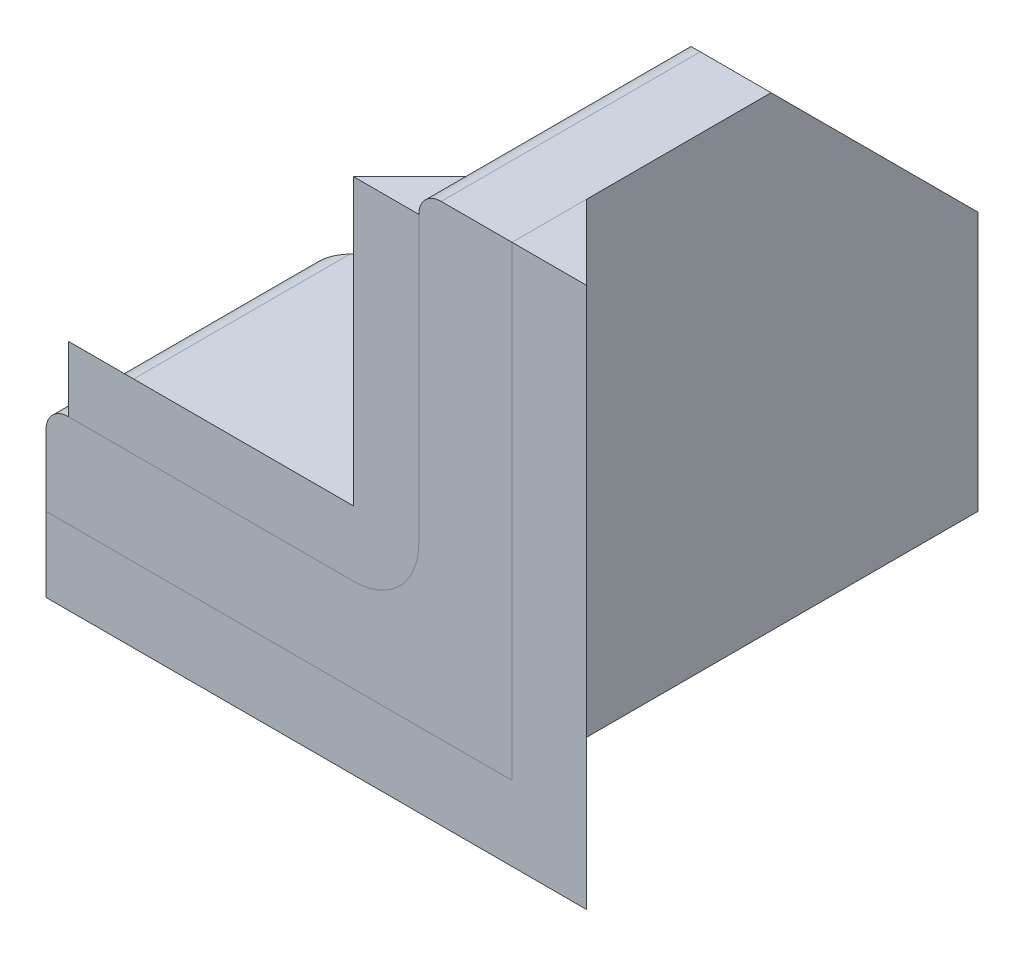
ISO-10303-21;
HEADER;
FILE_DESCRIPTION(('STEP AP214'),'2;1');
FILE_NAME('part.step','',(''),(''),'','','');
FILE_SCHEMA(('AUTOMOTIVE_DESIGN { 1 0 10303 214 1 1 1 1 }'));
ENDSEC;
DATA;
#1=APPLICATION_CONTEXT('core data for automotive mechanical design processes');
#2=APPLICATION_PROTOCOL_DEFINITION('international standard','automotive_design',2000,#1);
#3=PRODUCT_CONTEXT('',#1,'mechanical');
#4=PRODUCT('Part','Part','',(#3));
#5=PRODUCT_RELATED_PRODUCT_CATEGORY('part','',(#4));
#6=PRODUCT_DEFINITION_FORMATION('','',#4);
#7=PRODUCT_DEFINITION_CONTEXT('part definition',#1,'design');
#8=PRODUCT_DEFINITION('design','',#6,#7);
#9=PRODUCT_DEFINITION_SHAPE('','',#8);
#10=(LENGTH_UNIT() NAMED_UNIT(*) SI_UNIT(.MILLI.,.METRE.));
#11=(NAMED_UNIT(*) PLANE_ANGLE_UNIT() SI_UNIT($,.RADIAN.));
#12=(NAMED_UNIT(*) SI_UNIT($,.STERADIAN.) SOLID_ANGLE_UNIT());
#13=UNCERTAINTY_MEASURE_WITH_UNIT(LENGTH_MEASURE(1.E-05),#10,'distance_accuracy_value','');
#14=(GEOMETRIC_REPRESENTATION_CONTEXT(3) GLOBAL_UNCERTAINTY_ASSIGNED_CONTEXT((#13)) GLOBAL_UNIT_ASSIGNED_CONTEXT((#10,
#11,#12)) REPRESENTATION_CONTEXT('',''));
#15=CARTESIAN_POINT('',(0.,0.,0.));
#16=DIRECTION('',(0.,0.,1.));
#17=DIRECTION('',(1.,0.,0.));
#18=AXIS2_PLACEMENT_3D('',#15,#16,#17);
#19=CARTESIAN_POINT('',(0.,0.,-4.));
#20=DIRECTION('',(0.,-1.,0.));
#21=DIRECTION('',(1.,0.,0.));
#22=AXIS2_PLACEMENT_3D('',#19,#20,#21);
#23=PLANE('',#22);
#24=DIRECTION('',(0.,0.,-1.));
#25=VECTOR('',#24,1.);
#26=CARTESIAN_POINT('',(-25.,0.,-4.));
#27=LINE('',#26,#25);
#28=CARTESIAN_POINT('',(-25.,0.,0.));
#29=VERTEX_POINT('',#28);
#30=CARTESIAN_POINT('',(-25.,0.,-4.));
#31=VERTEX_POINT('',#30);
#32=EDGE_CURVE('E63',#29,#31,#27,.T.);
#33=ORIENTED_EDGE('',*,*,#32,.F.);
#34=DIRECTION('',(-1.,0.,0.));
#35=VECTOR('',#34,1.);
#36=CARTESIAN_POINT('',(0.,0.,0.));
#37=LINE('',#36,#35);
#38=CARTESIAN_POINT('',(0.,0.,0.));
#39=VERTEX_POINT('',#38);
#40=EDGE_CURVE('E128',#39,#29,#37,.T.);
#41=ORIENTED_EDGE('',*,*,#40,.F.);
#42=DIRECTION('',(0.,0.,1.));
#43=VECTOR('',#42,1.);
#44=CARTESIAN_POINT('',(0.,0.,-4.));
#45=LINE('',#44,#43);
#46=CARTESIAN_POINT('',(0.,0.,-4.));
#47=VERTEX_POINT('',#46);
#48=EDGE_CURVE('E120',#47,#39,#45,.T.);
#49=ORIENTED_EDGE('',*,*,#48,.F.);
#50=DIRECTION('',(-1.,0.,0.));
#51=VECTOR('',#50,1.);
#52=CARTESIAN_POINT('',(0.,0.,-4.));
#53=LINE('',#52,#51);
#54=EDGE_CURVE('E133',#47,#31,#53,.T.);
#55=ORIENTED_EDGE('',*,*,#54,.T.);
#56=EDGE_LOOP('',(#33,#41,#49,#55));
#57=FACE_BOUND('',#56,.T.);
#58=ADVANCED_FACE('F55',(#57),#23,.F.);
#59=CARTESIAN_POINT('',(5.21895141649746,-5.21895141649746,1.21895141649746));
#60=DIRECTION('',(0.,0.707106781186547,0.707106781186547));
#61=DIRECTION('',(0.,-0.707106781186548,0.707106781186548));
#62=AXIS2_PLACEMENT_3D('',#59,#60,#61);
#63=PLANE('',#62);
#64=DIRECTION('',(0.,-0.707106781186548,0.707106781186548));
#65=VECTOR('',#64,1.);
#66=CARTESIAN_POINT('',(-25.,-5.21895141649746,1.21895141649746));
#67=LINE('',#66,#65);
#68=CARTESIAN_POINT('',(-25.,-4.,0.));
#69=VERTEX_POINT('',#68);
#70=EDGE_CURVE('E13',#31,#69,#67,.T.);
#71=ORIENTED_EDGE('',*,*,#70,.F.);
#72=ORIENTED_EDGE('',*,*,#54,.F.);
#73=DIRECTION('',(-0.577350269189626,0.577350269189626,-0.577350269189626));
#74=VECTOR('',#73,1.);
#75=CARTESIAN_POINT('',(5.21895141649746,-5.21895141649746,1.21895141649746));
#76=LINE('',#75,#74);
#77=CARTESIAN_POINT('',(4.,-4.,0.));
#78=VERTEX_POINT('',#77);
#79=EDGE_CURVE('E104',#78,#47,#76,.T.);
#80=ORIENTED_EDGE('',*,*,#79,.F.);
#81=DIRECTION('',(-1.,0.,0.));
#82=VECTOR('',#81,1.);
#83=CARTESIAN_POINT('',(4.,-4.,0.));
#84=LINE('',#83,#82);
#85=EDGE_CURVE('E131',#78,#69,#84,.T.);
#86=ORIENTED_EDGE('',*,*,#85,.T.);
#87=EDGE_LOOP('',(#71,#72,#80,#86));
#88=FACE_BOUND('',#87,.T.);
#89=ADVANCED_FACE('F57',(#88),#63,.F.);
#90=CARTESIAN_POINT('',(0.,25.,-4.));
#91=DIRECTION('',(0.,1.,0.));
#92=DIRECTION('',(0.,0.,1.));
#93=AXIS2_PLACEMENT_3D('',#90,#91,#92);
#94=PLANE('',#93);
#95=DIRECTION('',(-0.707106781186548,0.,-0.707106781186548));
#96=VECTOR('',#95,1.);
#97=CARTESIAN_POINT('',(4.,25.,0.));
#98=LINE('',#97,#96);
#99=CARTESIAN_POINT('',(4.,25.,0.));
#100=VERTEX_POINT('',#99);
#101=CARTESIAN_POINT('',(0.,25.,-4.));
#102=VERTEX_POINT('',#101);
#103=EDGE_CURVE('E101',#100,#102,#98,.T.);
#104=ORIENTED_EDGE('',*,*,#103,.T.);
#105=DIRECTION('',(0.,0.,1.));
#106=VECTOR('',#105,1.);
#107=CARTESIAN_POINT('',(0.,25.,-4.));
#108=LINE('',#107,#106);
#109=CARTESIAN_POINT('',(0.,25.,0.));
#110=VERTEX_POINT('',#109);
#111=EDGE_CURVE('E111',#102,#110,#108,.T.);
#112=ORIENTED_EDGE('',*,*,#111,.T.);
#113=DIRECTION('',(1.,0.,0.));
#114=VECTOR('',#113,1.);
#115=CARTESIAN_POINT('',(0.,25.,0.));
#116=LINE('',#115,#114);
#117=EDGE_CURVE('E108',#110,#100,#116,.T.);
#118=ORIENTED_EDGE('',*,*,#117,.T.);
#119=EDGE_LOOP('',(#104,#112,#118));
#120=FACE_BOUND('',#119,.T.);
#121=ADVANCED_FACE('F117',(#120),#94,.T.);
#122=CARTESIAN_POINT('',(4.,-7.65685424949238,0.));
#123=DIRECTION('',(0.707106781186547,0.,-0.707106781186547));
#124=DIRECTION('',(-0.707106781186548,0.,-0.707106781186548));
#125=AXIS2_PLACEMENT_3D('',#122,#123,#124);
#126=PLANE('',#125);
#127=DIRECTION('',(0.,1.,0.));
#128=VECTOR('',#127,1.);
#129=CARTESIAN_POINT('',(4.,-7.65685424949238,0.));
#130=LINE('',#129,#128);
#131=EDGE_CURVE('E124',#78,#100,#130,.T.);
#132=ORIENTED_EDGE('',*,*,#131,.F.);
#133=ORIENTED_EDGE('',*,*,#79,.T.);
#134=DIRECTION('',(0.,1.,0.));
#135=VECTOR('',#134,1.);
#136=CARTESIAN_POINT('',(0.,-7.65685424949238,-4.));
#137=LINE('',#136,#135);
#138=EDGE_CURVE('E96',#47,#102,#137,.T.);
#139=ORIENTED_EDGE('',*,*,#138,.T.);
#140=ORIENTED_EDGE('',*,*,#103,.F.);
#141=EDGE_LOOP('',(#132,#133,#139,#140));
#142=FACE_BOUND('',#141,.T.);
#143=ADVANCED_FACE('F99',(#142),#126,.T.);
#144=CARTESIAN_POINT('',(0.,-7.65685424949238,-4.));
#145=DIRECTION('',(-1.,0.,0.));
#146=DIRECTION('',(0.,0.,1.));
#147=AXIS2_PLACEMENT_3D('',#144,#145,#146);
#148=PLANE('',#147);
#149=ORIENTED_EDGE('',*,*,#138,.F.);
#150=ORIENTED_EDGE('',*,*,#48,.T.);
#151=DIRECTION('',(0.,1.,0.));
#152=VECTOR('',#151,1.);
#153=CARTESIAN_POINT('',(0.,-7.65685424949238,0.));
#154=LINE('',#153,#152);
#155=EDGE_CURVE('E107',#39,#110,#154,.T.);
#156=ORIENTED_EDGE('',*,*,#155,.T.);
#157=ORIENTED_EDGE('',*,*,#111,.F.);
#158=EDGE_LOOP('',(#149,#150,#156,#157));
#159=FACE_BOUND('',#158,.T.);
#160=ADVANCED_FACE('F112',(#159),#148,.T.);
#161=CARTESIAN_POINT('',(0.,-7.65685424949238,0.));
#162=DIRECTION('',(0.,0.,1.));
#163=DIRECTION('',(1.,0.,0.));
#164=AXIS2_PLACEMENT_3D('',#161,#162,#163);
#165=PLANE('',#164);
#166=ORIENTED_EDGE('',*,*,#155,.F.);
#167=ORIENTED_EDGE('',*,*,#40,.T.);
#168=DIRECTION('',(0.,1.,0.));
#169=VECTOR('',#168,1.);
#170=CARTESIAN_POINT('',(-25.,-3.82842712474619,0.));
#171=LINE('',#170,#169);
#172=EDGE_CURVE('E71',#69,#29,#171,.T.);
#173=ORIENTED_EDGE('',*,*,#172,.F.);
#174=ORIENTED_EDGE('',*,*,#85,.F.);
#175=ORIENTED_EDGE('',*,*,#131,.T.);
#176=ORIENTED_EDGE('',*,*,#117,.F.);
#177=EDGE_LOOP('',(#166,#167,#173,#174,#175,#176));
#178=FACE_BOUND('',#177,.T.);
#179=ADVANCED_FACE('F140',(#178),#165,.T.);
#180=CARTESIAN_POINT('',(-25.,-2.,-2.));
#181=DIRECTION('',(-1.,0.,0.));
#182=DIRECTION('',(0.,-1.,0.));
#183=AXIS2_PLACEMENT_3D('',#180,#181,#182);
#184=PLANE('',#183);
#185=ORIENTED_EDGE('',*,*,#32,.T.);
#186=ORIENTED_EDGE('',*,*,#70,.T.);
#187=ORIENTED_EDGE('',*,*,#172,.T.);
#188=EDGE_LOOP('',(#185,#186,#187));
#189=FACE_BOUND('',#188,.T.);
#190=ADVANCED_FACE('F138',(#189),#184,.T.);
#191=CLOSED_SHELL('',(#58,#89,#121,#143,#160,#179,#190));
#192=MANIFOLD_SOLID_BREP('B2',#191);
#193=CARTESIAN_POINT('',(-8.5,5.,-3.5));
#194=DIRECTION('',(0.,-0.707106781186548,0.707106781186548));
#195=DIRECTION('',(0.,-0.707106781186548,-0.707106781186548));
#196=AXIS2_PLACEMENT_3D('',#193,#194,#195);
#197=PLANE('',#196);
#198=DIRECTION('',(0.,0.707106781186547,0.707106781186547));
#199=VECTOR('',#198,1.);
#200=CARTESIAN_POINT('',(-8.5,5.,-3.5));
#201=LINE('',#200,#199);
#202=CARTESIAN_POINT('',(-8.5,5.,-3.5));
#203=VERTEX_POINT('',#202);
#204=CARTESIAN_POINT('',(-8.5,8.5,0.));
#205=VERTEX_POINT('',#204);
#206=EDGE_CURVE('E272',#203,#205,#201,.T.);
#207=ORIENTED_EDGE('',*,*,#206,.F.);
#208=DIRECTION('',(-1.,0.,0.));
#209=VECTOR('',#208,1.);
#210=CARTESIAN_POINT('',(-8.5,5.,-3.5));
#211=LINE('',#210,#209);
#212=CARTESIAN_POINT('',(-23.8,5.,-3.5));
#213=VERTEX_POINT('',#212);
#214=EDGE_CURVE('E218',#203,#213,#211,.T.);
#215=ORIENTED_EDGE('',*,*,#214,.T.);
#216=DIRECTION('',(0.,0.707106781186547,0.707106781186547));
#217=VECTOR('',#216,1.);
#218=CARTESIAN_POINT('',(-23.8,5.,-3.5));
#219=LINE('',#218,#217);
#220=CARTESIAN_POINT('',(-23.8,8.5,0.));
#221=VERTEX_POINT('',#220);
#222=EDGE_CURVE('E225',#213,#221,#219,.T.);
#223=ORIENTED_EDGE('',*,*,#222,.T.);
#224=DIRECTION('',(-1.,0.,0.));
#225=VECTOR('',#224,1.);
#226=CARTESIAN_POINT('',(-8.5,8.5,0.));
#227=LINE('',#226,#225);
#228=EDGE_CURVE('E53',#205,#221,#227,.T.);
#229=ORIENTED_EDGE('',*,*,#228,.F.);
#230=EDGE_LOOP('',(#207,#215,#223,#229));
#231=FACE_BOUND('',#230,.T.);
#232=ADVANCED_FACE('F211',(#231),#197,.F.);
#233=CARTESIAN_POINT('',(-8.5,5.,0.));
#234=DIRECTION('',(0.,1.,0.));
#235=DIRECTION('',(-1.,0.,0.));
#236=AXIS2_PLACEMENT_3D('',#233,#234,#235);
#237=PLANE('',#236);
#238=DIRECTION('',(0.,0.,-1.));
#239=VECTOR('',#238,1.);
#240=CARTESIAN_POINT('',(-8.5,5.,0.));
#241=LINE('',#240,#239);
#242=CARTESIAN_POINT('',(-8.5,5.,0.));
#243=VERTEX_POINT('',#242);
#244=EDGE_CURVE('E295',#243,#203,#241,.T.);
#245=ORIENTED_EDGE('',*,*,#244,.F.);
#246=DIRECTION('',(-1.,0.,0.));
#247=VECTOR('',#246,1.);
#248=CARTESIAN_POINT('',(-8.5,5.,0.));
#249=LINE('',#248,#247);
#250=CARTESIAN_POINT('',(-23.8,5.,0.));
#251=VERTEX_POINT('',#250);
#252=EDGE_CURVE('E267',#243,#251,#249,.T.);
#253=ORIENTED_EDGE('',*,*,#252,.T.);
#254=DIRECTION('',(0.,0.,-1.));
#255=VECTOR('',#254,1.);
#256=CARTESIAN_POINT('',(-23.8,5.,0.));
#257=LINE('',#256,#255);
#258=EDGE_CURVE('E233',#251,#213,#257,.T.);
#259=ORIENTED_EDGE('',*,*,#258,.T.);
#260=ORIENTED_EDGE('',*,*,#214,.F.);
#261=EDGE_LOOP('',(#245,#253,#259,#260));
#262=FACE_BOUND('',#261,.T.);
#263=ADVANCED_FACE('F305',(#262),#237,.F.);
#264=CARTESIAN_POINT('',(-8.5,8.5,-3.5));
#265=DIRECTION('',(0.,0.,-1.));
#266=DIRECTION('',(-1.,0.,0.));
#267=AXIS2_PLACEMENT_3D('',#264,#265,#266);
#268=CONICAL_SURFACE('',#267,3.5,0.785398163397448);
#269=DIRECTION('',(-0.707106781186547,0.,0.707106781186547));
#270=VECTOR('',#269,1.);
#271=CARTESIAN_POINT('',(-5.,8.5,-3.5));
#272=LINE('',#271,#270);
#273=CARTESIAN_POINT('',(-5.,8.5,-3.5));
#274=VERTEX_POINT('',#273);
#275=EDGE_CURVE('E280',#274,#205,#272,.T.);
#276=ORIENTED_EDGE('',*,*,#275,.F.);
#277=CARTESIAN_POINT('',(-8.5,8.5,-3.5));
#278=DIRECTION('',(0.,0.,-1.));
#279=DIRECTION('',(-1.,0.,0.));
#280=AXIS2_PLACEMENT_3D('',#277,#278,#279);
#281=CIRCLE('',#280,3.5);
#282=EDGE_CURVE('E271',#274,#203,#281,.T.);
#283=ORIENTED_EDGE('',*,*,#282,.T.);
#284=ORIENTED_EDGE('',*,*,#206,.T.);
#285=EDGE_LOOP('',(#276,#283,#284));
#286=FACE_BOUND('',#285,.T.);
#287=ADVANCED_FACE('F307',(#286),#268,.F.);
#288=CARTESIAN_POINT('',(-8.5,8.5,0.));
#289=DIRECTION('',(0.,0.,-1.));
#290=DIRECTION('',(-1.,0.,0.));
#291=AXIS2_PLACEMENT_3D('',#288,#289,#290);
#292=CYLINDRICAL_SURFACE('',#291,3.5);
#293=DIRECTION('',(0.,0.,-1.));
#294=VECTOR('',#293,1.);
#295=CARTESIAN_POINT('',(-5.,8.5,0.));
#296=LINE('',#295,#294);
#297=CARTESIAN_POINT('',(-5.,8.5,0.));
#298=VERTEX_POINT('',#297);
#299=EDGE_CURVE('E275',#298,#274,#296,.T.);
#300=ORIENTED_EDGE('',*,*,#299,.F.);
#301=CARTESIAN_POINT('',(-8.5,8.5,0.));
#302=DIRECTION('',(0.,0.,-1.));
#303=DIRECTION('',(-1.,0.,0.));
#304=AXIS2_PLACEMENT_3D('',#301,#302,#303);
#305=CIRCLE('',#304,3.5);
#306=EDGE_CURVE('E260',#298,#243,#305,.T.);
#307=ORIENTED_EDGE('',*,*,#306,.T.);
#308=ORIENTED_EDGE('',*,*,#244,.T.);
#309=ORIENTED_EDGE('',*,*,#282,.F.);
#310=EDGE_LOOP('',(#300,#307,#308,#309));
#311=FACE_BOUND('',#310,.T.);
#312=ADVANCED_FACE('F276',(#311),#292,.T.);
#313=CARTESIAN_POINT('',(-8.5,8.5,0.));
#314=DIRECTION('',(0.,0.,1.));
#315=DIRECTION('',(1.,0.,0.));
#316=AXIS2_PLACEMENT_3D('',#313,#314,#315);
#317=PLANE('',#316);
#318=DIRECTION('',(1.,0.,0.));
#319=VECTOR('',#318,1.);
#320=CARTESIAN_POINT('',(-8.5,23.8,0.));
#321=LINE('',#320,#319);
#322=CARTESIAN_POINT('',(-8.5,23.8,0.));
#323=VERTEX_POINT('',#322);
#324=CARTESIAN_POINT('',(-5.,23.8,0.));
#325=VERTEX_POINT('',#324);
#326=EDGE_CURVE('E316',#323,#325,#321,.T.);
#327=ORIENTED_EDGE('',*,*,#326,.F.);
#328=DIRECTION('',(0.,1.,0.));
#329=VECTOR('',#328,1.);
#330=CARTESIAN_POINT('',(-8.5,8.5,0.));
#331=LINE('',#330,#329);
#332=EDGE_CURVE('E289',#205,#323,#331,.T.);
#333=ORIENTED_EDGE('',*,*,#332,.F.);
#334=ORIENTED_EDGE('',*,*,#228,.T.);
#335=DIRECTION('',(0.,-1.,0.));
#336=VECTOR('',#335,1.);
#337=CARTESIAN_POINT('',(-23.8,8.5,0.));
#338=LINE('',#337,#336);
#339=EDGE_CURVE('E300',#221,#251,#338,.T.);
#340=ORIENTED_EDGE('',*,*,#339,.T.);
#341=ORIENTED_EDGE('',*,*,#252,.F.);
#342=ORIENTED_EDGE('',*,*,#306,.F.);
#343=DIRECTION('',(0.,1.,0.));
#344=VECTOR('',#343,1.);
#345=CARTESIAN_POINT('',(-5.,8.5,0.));
#346=LINE('',#345,#344);
#347=EDGE_CURVE('E265',#298,#325,#346,.T.);
#348=ORIENTED_EDGE('',*,*,#347,.T.);
#349=EDGE_LOOP('',(#327,#333,#334,#340,#341,#342,#348));
#350=FACE_BOUND('',#349,.T.);
#351=ADVANCED_FACE('F263',(#350),#317,.T.);
#352=CARTESIAN_POINT('',(-5.,8.5,-3.5));
#353=DIRECTION('',(-0.707106781186548,0.,-0.707106781186548));
#354=DIRECTION('',(-0.707106781186548,0.,0.707106781186548));
#355=AXIS2_PLACEMENT_3D('',#352,#353,#354);
#356=PLANE('',#355);
#357=DIRECTION('',(-0.707106781186547,0.,0.707106781186547));
#358=VECTOR('',#357,1.);
#359=CARTESIAN_POINT('',(-5.,23.8,-3.5));
#360=LINE('',#359,#358);
#361=CARTESIAN_POINT('',(-5.,23.8,-3.5));
#362=VERTEX_POINT('',#361);
#363=EDGE_CURVE('E281',#362,#323,#360,.T.);
#364=ORIENTED_EDGE('',*,*,#363,.F.);
#365=DIRECTION('',(0.,1.,0.));
#366=VECTOR('',#365,1.);
#367=CARTESIAN_POINT('',(-5.,8.5,-3.5));
#368=LINE('',#367,#366);
#369=EDGE_CURVE('E287',#274,#362,#368,.T.);
#370=ORIENTED_EDGE('',*,*,#369,.F.);
#371=ORIENTED_EDGE('',*,*,#275,.T.);
#372=ORIENTED_EDGE('',*,*,#332,.T.);
#373=EDGE_LOOP('',(#364,#370,#371,#372));
#374=FACE_BOUND('',#373,.T.);
#375=ADVANCED_FACE('F312',(#374),#356,.T.);
#376=CARTESIAN_POINT('',(-5.,8.5,0.));
#377=DIRECTION('',(1.,0.,0.));
#378=DIRECTION('',(0.,1.,0.));
#379=AXIS2_PLACEMENT_3D('',#376,#377,#378);
#380=PLANE('',#379);
#381=DIRECTION('',(0.,0.,-1.));
#382=VECTOR('',#381,1.);
#383=CARTESIAN_POINT('',(-5.,23.8,0.));
#384=LINE('',#383,#382);
#385=EDGE_CURVE('E285',#325,#362,#384,.T.);
#386=ORIENTED_EDGE('',*,*,#385,.F.);
#387=ORIENTED_EDGE('',*,*,#347,.F.);
#388=ORIENTED_EDGE('',*,*,#299,.T.);
#389=ORIENTED_EDGE('',*,*,#369,.T.);
#390=EDGE_LOOP('',(#386,#387,#388,#389));
#391=FACE_BOUND('',#390,.T.);
#392=ADVANCED_FACE('F283',(#391),#380,.T.);
#393=CARTESIAN_POINT('',(-23.8,5.,0.));
#394=DIRECTION('',(1.,0.,0.));
#395=DIRECTION('',(0.,0.,1.));
#396=AXIS2_PLACEMENT_3D('',#393,#394,#395);
#397=PLANE('',#396);
#398=ORIENTED_EDGE('',*,*,#339,.F.);
#399=ORIENTED_EDGE('',*,*,#222,.F.);
#400=ORIENTED_EDGE('',*,*,#258,.F.);
#401=EDGE_LOOP('',(#398,#399,#400));
#402=FACE_BOUND('',#401,.T.);
#403=ADVANCED_FACE('F321',(#402),#397,.F.);
#404=CARTESIAN_POINT('',(-5.,23.8,0.));
#405=DIRECTION('',(0.,1.,0.));
#406=DIRECTION('',(0.,0.,1.));
#407=AXIS2_PLACEMENT_3D('',#404,#405,#406);
#408=PLANE('',#407);
#409=ORIENTED_EDGE('',*,*,#326,.T.);
#410=ORIENTED_EDGE('',*,*,#385,.T.);
#411=ORIENTED_EDGE('',*,*,#363,.T.);
#412=EDGE_LOOP('',(#409,#410,#411));
#413=FACE_BOUND('',#412,.T.);
#414=ADVANCED_FACE('F315',(#413),#408,.T.);
#415=CLOSED_SHELL('',(#232,#263,#287,#312,#351,#375,#392,#403,#414));
#416=MANIFOLD_SOLID_BREP('B7',#415);
#417=CARTESIAN_POINT('',(-25.,0.,-25.));
#418=DIRECTION('',(0.,1.,0.));
#419=DIRECTION('',(-1.,0.,0.));
#420=AXIS2_PLACEMENT_3D('',#417,#418,#419);
#421=PLANE('',#420);
#422=DIRECTION('',(0.,0.,1.));
#423=VECTOR('',#422,1.);
#424=CARTESIAN_POINT('',(-25.,0.,-25.));
#425=LINE('',#424,#423);
#426=CARTESIAN_POINT('',(-25.,0.,-13.9));
#427=VERTEX_POINT('',#426);
#428=CARTESIAN_POINT('',(-25.,0.,0.));
#429=VERTEX_POINT('',#428);
#430=EDGE_CURVE('E558',#427,#429,#425,.T.);
#431=ORIENTED_EDGE('',*,*,#430,.F.);
#432=DIRECTION('',(0.707106781186546,0.,-0.707106781186549));
#433=VECTOR('',#432,1.);
#434=CARTESIAN_POINT('',(-13.9,0.,-25.));
#435=LINE('',#434,#433);
#436=CARTESIAN_POINT('',(-13.9,0.,-25.));
#437=VERTEX_POINT('',#436);
#438=EDGE_CURVE('E209',#427,#437,#435,.T.);
#439=ORIENTED_EDGE('',*,*,#438,.T.);
#440=DIRECTION('',(-1.,0.,0.));
#441=VECTOR('',#440,1.);
#442=CARTESIAN_POINT('',(-25.,0.,-25.));
#443=LINE('',#442,#441);
#444=CARTESIAN_POINT('',(0.,0.,-25.));
#445=VERTEX_POINT('',#444);
#446=EDGE_CURVE('E493',#445,#437,#443,.T.);
#447=ORIENTED_EDGE('',*,*,#446,.F.);
#448=DIRECTION('',(0.,0.,1.));
#449=VECTOR('',#448,1.);
#450=CARTESIAN_POINT('',(0.,0.,-25.));
#451=LINE('',#450,#449);
#452=CARTESIAN_POINT('',(0.,0.,0.));
#453=VERTEX_POINT('',#452);
#454=EDGE_CURVE('E516',#445,#453,#451,.T.);
#455=ORIENTED_EDGE('',*,*,#454,.T.);
#456=DIRECTION('',(-1.,0.,0.));
#457=VECTOR('',#456,1.);
#458=CARTESIAN_POINT('',(-25.,0.,0.));
#459=LINE('',#458,#457);
#460=EDGE_CURVE('E517',#453,#429,#459,.T.);
#461=ORIENTED_EDGE('',*,*,#460,.T.);
#462=EDGE_LOOP('',(#431,#439,#447,#455,#461));
#463=FACE_BOUND('',#462,.T.);
#464=ADVANCED_FACE('F400',(#463),#421,.F.);
#465=CARTESIAN_POINT('',(-25.,0.,-25.));
#466=DIRECTION('',(1.,0.,0.));
#467=DIRECTION('',(0.,0.,-1.));
#468=AXIS2_PLACEMENT_3D('',#465,#466,#467);
#469=PLANE('',#468);
#470=DIRECTION('',(0.,0.,1.));
#471=VECTOR('',#470,1.);
#472=CARTESIAN_POINT('',(-25.,3.8,-25.));
#473=LINE('',#472,#471);
#474=CARTESIAN_POINT('',(-25.,3.8,-13.9));
#475=VERTEX_POINT('',#474);
#476=CARTESIAN_POINT('',(-25.,3.8,0.));
#477=VERTEX_POINT('',#476);
#478=EDGE_CURVE('E556',#475,#477,#473,.T.);
#479=ORIENTED_EDGE('',*,*,#478,.F.);
#480=DIRECTION('',(0.,-1.,0.));
#481=VECTOR('',#480,1.);
#482=CARTESIAN_POINT('',(-25.,0.,-13.9));
#483=LINE('',#482,#481);
#484=EDGE_CURVE('E408',#475,#427,#483,.T.);
#485=ORIENTED_EDGE('',*,*,#484,.T.);
#486=ORIENTED_EDGE('',*,*,#430,.T.);
#487=DIRECTION('',(0.,1.,0.));
#488=VECTOR('',#487,1.);
#489=CARTESIAN_POINT('',(-25.,0.,0.));
#490=LINE('',#489,#488);
#491=EDGE_CURVE('E521',#429,#477,#490,.T.);
#492=ORIENTED_EDGE('',*,*,#491,.T.);
#493=EDGE_LOOP('',(#479,#485,#486,#492));
#494=FACE_BOUND('',#493,.T.);
#495=ADVANCED_FACE('F595',(#494),#469,.F.);
#496=CARTESIAN_POINT('',(-23.8,3.8,-25.));
#497=DIRECTION('',(0.,0.,1.));
#498=DIRECTION('',(1.,0.,0.));
#499=AXIS2_PLACEMENT_3D('',#496,#497,#498);
#500=CYLINDRICAL_SURFACE('',#499,1.2);
#501=DIRECTION('',(0.,0.,1.));
#502=VECTOR('',#501,1.);
#503=CARTESIAN_POINT('',(-23.8,5.,-25.));
#504=LINE('',#503,#502);
#505=CARTESIAN_POINT('',(-23.8,5.,-15.1));
#506=VERTEX_POINT('',#505);
#507=CARTESIAN_POINT('',(-23.8,5.,0.));
#508=VERTEX_POINT('',#507);
#509=EDGE_CURVE('E502',#506,#508,#504,.T.);
#510=ORIENTED_EDGE('',*,*,#509,.F.);
#511=CARTESIAN_POINT('',(-23.8,3.8,-15.1));
#512=DIRECTION('',(-0.707106781186549,0.,-0.707106781186546));
#513=DIRECTION('',(-0.707106781186546,0.,0.707106781186549));
#514=AXIS2_PLACEMENT_3D('',#511,#512,#513);
#515=ELLIPSE('',#514,1.69705627484772,1.2);
#516=EDGE_CURVE('E422',#506,#475,#515,.F.);
#517=ORIENTED_EDGE('',*,*,#516,.T.);
#518=ORIENTED_EDGE('',*,*,#478,.T.);
#519=CARTESIAN_POINT('',(-23.8,3.8,0.));
#520=DIRECTION('',(0.,0.,-1.));
#521=DIRECTION('',(1.,0.,0.));
#522=AXIS2_PLACEMENT_3D('',#519,#520,#521);
#523=CIRCLE('',#522,1.2);
#524=EDGE_CURVE('E524',#477,#508,#523,.T.);
#525=ORIENTED_EDGE('',*,*,#524,.T.);
#526=EDGE_LOOP('',(#510,#517,#518,#525));
#527=FACE_BOUND('',#526,.T.);
#528=ADVANCED_FACE('F579',(#527),#500,.T.);
#529=CARTESIAN_POINT('',(-8.5,5.,-25.));
#530=DIRECTION('',(0.,-1.,0.));
#531=DIRECTION('',(0.,0.,-1.));
#532=AXIS2_PLACEMENT_3D('',#529,#530,#531);
#533=PLANE('',#532);
#534=DIRECTION('',(1.,0.,0.));
#535=VECTOR('',#534,1.);
#536=CARTESIAN_POINT('',(-8.5,5.,-25.));
#537=LINE('',#536,#535);
#538=CARTESIAN_POINT('',(-13.9,5.,-25.));
#539=VERTEX_POINT('',#538);
#540=CARTESIAN_POINT('',(-8.5,5.,-25.));
#541=VERTEX_POINT('',#540);
#542=EDGE_CURVE('E482',#539,#541,#537,.T.);
#543=ORIENTED_EDGE('',*,*,#542,.F.);
#544=DIRECTION('',(-0.707106781186546,0.,0.707106781186549));
#545=VECTOR('',#544,1.);
#546=CARTESIAN_POINT('',(-13.9,5.,-25.));
#547=LINE('',#546,#545);
#548=EDGE_CURVE('E572',#539,#506,#547,.T.);
#549=ORIENTED_EDGE('',*,*,#548,.T.);
#550=ORIENTED_EDGE('',*,*,#509,.T.);
#551=DIRECTION('',(1.,0.,0.));
#552=VECTOR('',#551,1.);
#553=CARTESIAN_POINT('',(-8.5,5.,0.));
#554=LINE('',#553,#552);
#555=CARTESIAN_POINT('',(-8.5,5.,0.));
#556=VERTEX_POINT('',#555);
#557=EDGE_CURVE('E499',#508,#556,#554,.T.);
#558=ORIENTED_EDGE('',*,*,#557,.T.);
#559=DIRECTION('',(0.,0.,1.));
#560=VECTOR('',#559,1.);
#561=CARTESIAN_POINT('',(-8.5,5.,-25.));
#562=LINE('',#561,#560);
#563=EDGE_CURVE('E496',#541,#556,#562,.T.);
#564=ORIENTED_EDGE('',*,*,#563,.F.);
#565=EDGE_LOOP('',(#543,#549,#550,#558,#564));
#566=FACE_BOUND('',#565,.T.);
#567=ADVANCED_FACE('F497',(#566),#533,.F.);
#568=CARTESIAN_POINT('',(-8.5,8.5,-25.));
#569=DIRECTION('',(0.,0.,1.));
#570=DIRECTION('',(1.,0.,0.));
#571=AXIS2_PLACEMENT_3D('',#568,#569,#570);
#572=CYLINDRICAL_SURFACE('',#571,3.5);
#573=CARTESIAN_POINT('',(-8.5,8.5,0.));
#574=DIRECTION('',(0.,0.,1.));
#575=DIRECTION('',(1.,0.,0.));
#576=AXIS2_PLACEMENT_3D('',#573,#574,#575);
#577=CIRCLE('',#576,3.5);
#578=CARTESIAN_POINT('',(-5.,8.5,0.));
#579=VERTEX_POINT('',#578);
#580=EDGE_CURVE('E529',#556,#579,#577,.T.);
#581=ORIENTED_EDGE('',*,*,#580,.T.);
#582=DIRECTION('',(0.,0.,1.));
#583=VECTOR('',#582,1.);
#584=CARTESIAN_POINT('',(-5.,8.5,-25.));
#585=LINE('',#584,#583);
#586=CARTESIAN_POINT('',(-5.,8.5,-25.));
#587=VERTEX_POINT('',#586);
#588=EDGE_CURVE('E503',#587,#579,#585,.T.);
#589=ORIENTED_EDGE('',*,*,#588,.F.);
#590=CARTESIAN_POINT('',(-8.5,8.5,-25.));
#591=DIRECTION('',(0.,0.,1.));
#592=DIRECTION('',(1.,0.,0.));
#593=AXIS2_PLACEMENT_3D('',#590,#591,#592);
#594=CIRCLE('',#593,3.5);
#595=EDGE_CURVE('E487',#541,#587,#594,.T.);
#596=ORIENTED_EDGE('',*,*,#595,.F.);
#597=ORIENTED_EDGE('',*,*,#563,.T.);
#598=EDGE_LOOP('',(#581,#589,#596,#597));
#599=FACE_BOUND('',#598,.T.);
#600=ADVANCED_FACE('F505',(#599),#572,.F.);
#601=CARTESIAN_POINT('',(-5.,23.8,-25.));
#602=DIRECTION('',(1.,0.,0.));
#603=DIRECTION('',(0.,1.,0.));
#604=AXIS2_PLACEMENT_3D('',#601,#602,#603);
#605=PLANE('',#604);
#606=DIRECTION('',(0.,0.,1.));
#607=VECTOR('',#606,1.);
#608=CARTESIAN_POINT('',(-5.,23.8,-25.));
#609=LINE('',#608,#607);
#610=CARTESIAN_POINT('',(-5.,23.8,-15.1));
#611=VERTEX_POINT('',#610);
#612=CARTESIAN_POINT('',(-5.,23.8,0.));
#613=VERTEX_POINT('',#612);
#614=EDGE_CURVE('E551',#611,#613,#609,.T.);
#615=ORIENTED_EDGE('',*,*,#614,.F.);
#616=DIRECTION('',(0.,-0.707106781186546,-0.707106781186549));
#617=VECTOR('',#616,1.);
#618=CARTESIAN_POINT('',(-5.,13.9,-25.));
#619=LINE('',#618,#617);
#620=CARTESIAN_POINT('',(-5.,13.9,-25.));
#621=VERTEX_POINT('',#620);
#622=EDGE_CURVE('E570',#611,#621,#619,.T.);
#623=ORIENTED_EDGE('',*,*,#622,.T.);
#624=DIRECTION('',(0.,1.,0.));
#625=VECTOR('',#624,1.);
#626=CARTESIAN_POINT('',(-5.,23.8,-25.));
#627=LINE('',#626,#625);
#628=EDGE_CURVE('E508',#587,#621,#627,.T.);
#629=ORIENTED_EDGE('',*,*,#628,.F.);
#630=ORIENTED_EDGE('',*,*,#588,.T.);
#631=DIRECTION('',(0.,1.,0.));
#632=VECTOR('',#631,1.);
#633=CARTESIAN_POINT('',(-5.,23.8,0.));
#634=LINE('',#633,#632);
#635=EDGE_CURVE('E531',#579,#613,#634,.T.);
#636=ORIENTED_EDGE('',*,*,#635,.T.);
#637=EDGE_LOOP('',(#615,#623,#629,#630,#636));
#638=FACE_BOUND('',#637,.T.);
#639=ADVANCED_FACE('F621',(#638),#605,.F.);
#640=CARTESIAN_POINT('',(-3.8,23.8,-25.));
#641=DIRECTION('',(0.,0.,1.));
#642=DIRECTION('',(1.,0.,0.));
#643=AXIS2_PLACEMENT_3D('',#640,#641,#642);
#644=CYLINDRICAL_SURFACE('',#643,1.2);
#645=DIRECTION('',(0.,0.,1.));
#646=VECTOR('',#645,1.);
#647=CARTESIAN_POINT('',(-3.8,25.,-25.));
#648=LINE('',#647,#646);
#649=CARTESIAN_POINT('',(-3.8,25.,-13.9));
#650=VERTEX_POINT('',#649);
#651=CARTESIAN_POINT('',(-3.8,25.,0.));
#652=VERTEX_POINT('',#651);
#653=EDGE_CURVE('E548',#650,#652,#648,.T.);
#654=ORIENTED_EDGE('',*,*,#653,.F.);
#655=CARTESIAN_POINT('',(-3.8,23.8,-15.1));
#656=DIRECTION('',(0.,0.707106781186549,-0.707106781186546));
#657=DIRECTION('',(0.,0.707106781186546,0.707106781186549));
#658=AXIS2_PLACEMENT_3D('',#655,#656,#657);
#659=ELLIPSE('',#658,1.69705627484772,1.2);
#660=EDGE_CURVE('E568',#650,#611,#659,.F.);
#661=ORIENTED_EDGE('',*,*,#660,.T.);
#662=ORIENTED_EDGE('',*,*,#614,.T.);
#663=CARTESIAN_POINT('',(-3.8,23.8,0.));
#664=DIRECTION('',(0.,0.,-1.));
#665=DIRECTION('',(-1.,0.,0.));
#666=AXIS2_PLACEMENT_3D('',#663,#664,#665);
#667=CIRCLE('',#666,1.2);
#668=EDGE_CURVE('E534',#613,#652,#667,.T.);
#669=ORIENTED_EDGE('',*,*,#668,.T.);
#670=EDGE_LOOP('',(#654,#661,#662,#669));
#671=FACE_BOUND('',#670,.T.);
#672=ADVANCED_FACE('F619',(#671),#644,.T.);
#673=CARTESIAN_POINT('',(0.,25.,-25.));
#674=DIRECTION('',(0.,-1.,0.));
#675=DIRECTION('',(0.,0.,-1.));
#676=AXIS2_PLACEMENT_3D('',#673,#674,#675);
#677=PLANE('',#676);
#678=DIRECTION('',(0.,0.,1.));
#679=VECTOR('',#678,1.);
#680=CARTESIAN_POINT('',(0.,25.,-25.));
#681=LINE('',#680,#679);
#682=CARTESIAN_POINT('',(0.,25.,-13.9));
#683=VERTEX_POINT('',#682);
#684=CARTESIAN_POINT('',(0.,25.,0.));
#685=VERTEX_POINT('',#684);
#686=EDGE_CURVE('E545',#683,#685,#681,.T.);
#687=ORIENTED_EDGE('',*,*,#686,.F.);
#688=DIRECTION('',(-1.,0.,0.));
#689=VECTOR('',#688,1.);
#690=CARTESIAN_POINT('',(-3.8,25.,-13.9));
#691=LINE('',#690,#689);
#692=EDGE_CURVE('E566',#683,#650,#691,.T.);
#693=ORIENTED_EDGE('',*,*,#692,.T.);
#694=ORIENTED_EDGE('',*,*,#653,.T.);
#695=DIRECTION('',(1.,0.,0.));
#696=VECTOR('',#695,1.);
#697=CARTESIAN_POINT('',(0.,25.,0.));
#698=LINE('',#697,#696);
#699=EDGE_CURVE('E537',#652,#685,#698,.T.);
#700=ORIENTED_EDGE('',*,*,#699,.T.);
#701=EDGE_LOOP('',(#687,#693,#694,#700));
#702=FACE_BOUND('',#701,.T.);
#703=ADVANCED_FACE('F626',(#702),#677,.F.);
#704=CARTESIAN_POINT('',(0.,0.,-25.));
#705=DIRECTION('',(-1.,0.,0.));
#706=DIRECTION('',(0.,0.,1.));
#707=AXIS2_PLACEMENT_3D('',#704,#705,#706);
#708=PLANE('',#707);
#709=DIRECTION('',(0.,-1.,0.));
#710=VECTOR('',#709,1.);
#711=CARTESIAN_POINT('',(0.,0.,-25.));
#712=LINE('',#711,#710);
#713=CARTESIAN_POINT('',(0.,13.9,-25.));
#714=VERTEX_POINT('',#713);
#715=EDGE_CURVE('E510',#714,#445,#712,.T.);
#716=ORIENTED_EDGE('',*,*,#715,.F.);
#717=DIRECTION('',(0.,0.707106781186546,0.707106781186549));
#718=VECTOR('',#717,1.);
#719=CARTESIAN_POINT('',(0.,13.9,-25.));
#720=LINE('',#719,#718);
#721=EDGE_CURVE('E564',#714,#683,#720,.T.);
#722=ORIENTED_EDGE('',*,*,#721,.T.);
#723=ORIENTED_EDGE('',*,*,#686,.T.);
#724=DIRECTION('',(0.,-1.,0.));
#725=VECTOR('',#724,1.);
#726=CARTESIAN_POINT('',(0.,0.,0.));
#727=LINE('',#726,#725);
#728=EDGE_CURVE('E540',#685,#453,#727,.T.);
#729=ORIENTED_EDGE('',*,*,#728,.T.);
#730=ORIENTED_EDGE('',*,*,#454,.F.);
#731=EDGE_LOOP('',(#716,#722,#723,#729,#730));
#732=FACE_BOUND('',#731,.T.);
#733=ADVANCED_FACE('F588',(#732),#708,.F.);
#734=CARTESIAN_POINT('',(-3.8,23.8,-25.));
#735=DIRECTION('',(0.,0.,-1.));
#736=DIRECTION('',(-1.,0.,0.));
#737=AXIS2_PLACEMENT_3D('',#734,#735,#736);
#738=PLANE('',#737);
#739=ORIENTED_EDGE('',*,*,#628,.T.);
#740=DIRECTION('',(1.,0.,0.));
#741=VECTOR('',#740,1.);
#742=CARTESIAN_POINT('',(0.,13.9,-25.));
#743=LINE('',#742,#741);
#744=EDGE_CURVE('E561',#621,#714,#743,.T.);
#745=ORIENTED_EDGE('',*,*,#744,.T.);
#746=ORIENTED_EDGE('',*,*,#715,.T.);
#747=ORIENTED_EDGE('',*,*,#446,.T.);
#748=DIRECTION('',(0.,1.,0.));
#749=VECTOR('',#748,1.);
#750=CARTESIAN_POINT('',(-13.9,3.8,-25.));
#751=LINE('',#750,#749);
#752=EDGE_CURVE('E491',#437,#539,#751,.T.);
#753=ORIENTED_EDGE('',*,*,#752,.T.);
#754=ORIENTED_EDGE('',*,*,#542,.T.);
#755=ORIENTED_EDGE('',*,*,#595,.T.);
#756=EDGE_LOOP('',(#739,#745,#746,#747,#753,#754,#755));
#757=FACE_BOUND('',#756,.T.);
#758=ADVANCED_FACE('F485',(#757),#738,.T.);
#759=CARTESIAN_POINT('',(-3.8,23.8,0.));
#760=DIRECTION('',(0.,0.,-1.));
#761=DIRECTION('',(-1.,0.,0.));
#762=AXIS2_PLACEMENT_3D('',#759,#760,#761);
#763=PLANE('',#762);
#764=ORIENTED_EDGE('',*,*,#460,.F.);
#765=ORIENTED_EDGE('',*,*,#728,.F.);
#766=ORIENTED_EDGE('',*,*,#699,.F.);
#767=ORIENTED_EDGE('',*,*,#668,.F.);
#768=ORIENTED_EDGE('',*,*,#635,.F.);
#769=ORIENTED_EDGE('',*,*,#580,.F.);
#770=ORIENTED_EDGE('',*,*,#557,.F.);
#771=ORIENTED_EDGE('',*,*,#524,.F.);
#772=ORIENTED_EDGE('',*,*,#491,.F.);
#773=EDGE_LOOP('',(#764,#765,#766,#767,#768,#769,#770,#771,#772));
#774=FACE_BOUND('',#773,.T.);
#775=ADVANCED_FACE('F593',(#774),#763,.F.);
#776=CARTESIAN_POINT('',(-3.8,13.9,-25.));
#777=DIRECTION('',(0.,0.707106781186549,-0.707106781186546));
#778=DIRECTION('',(0.,0.707106781186546,0.707106781186549));
#779=AXIS2_PLACEMENT_3D('',#776,#777,#778);
#780=PLANE('',#779);
#781=ORIENTED_EDGE('',*,*,#660,.F.);
#782=ORIENTED_EDGE('',*,*,#692,.F.);
#783=ORIENTED_EDGE('',*,*,#721,.F.);
#784=ORIENTED_EDGE('',*,*,#744,.F.);
#785=ORIENTED_EDGE('',*,*,#622,.F.);
#786=EDGE_LOOP('',(#781,#782,#783,#784,#785));
#787=FACE_BOUND('',#786,.T.);
#788=ADVANCED_FACE('F605',(#787),#780,.T.);
#789=CARTESIAN_POINT('',(-13.9,23.8,-25.));
#790=DIRECTION('',(-0.707106781186549,0.,-0.707106781186546));
#791=DIRECTION('',(-0.707106781186546,0.,0.707106781186549));
#792=AXIS2_PLACEMENT_3D('',#789,#790,#791);
#793=PLANE('',#792);
#794=ORIENTED_EDGE('',*,*,#438,.F.);
#795=ORIENTED_EDGE('',*,*,#484,.F.);
#796=ORIENTED_EDGE('',*,*,#516,.F.);
#797=ORIENTED_EDGE('',*,*,#548,.F.);
#798=ORIENTED_EDGE('',*,*,#752,.F.);
#799=EDGE_LOOP('',(#794,#795,#796,#797,#798));
#800=FACE_BOUND('',#799,.T.);
#801=ADVANCED_FACE('F402',(#800),#793,.T.);
#802=CLOSED_SHELL('',(#464,#495,#528,#567,#600,#639,#672,#703,#733,#758,#775,#788,#801));
#803=MANIFOLD_SOLID_BREP('B47',#802);
#804=ADVANCED_BREP_SHAPE_REPRESENTATION('',(#18,#192,#416,#803),#14);
#805=SHAPE_DEFINITION_REPRESENTATION(#9,#804);
ENDSEC;
END-ISO-10303-21;
